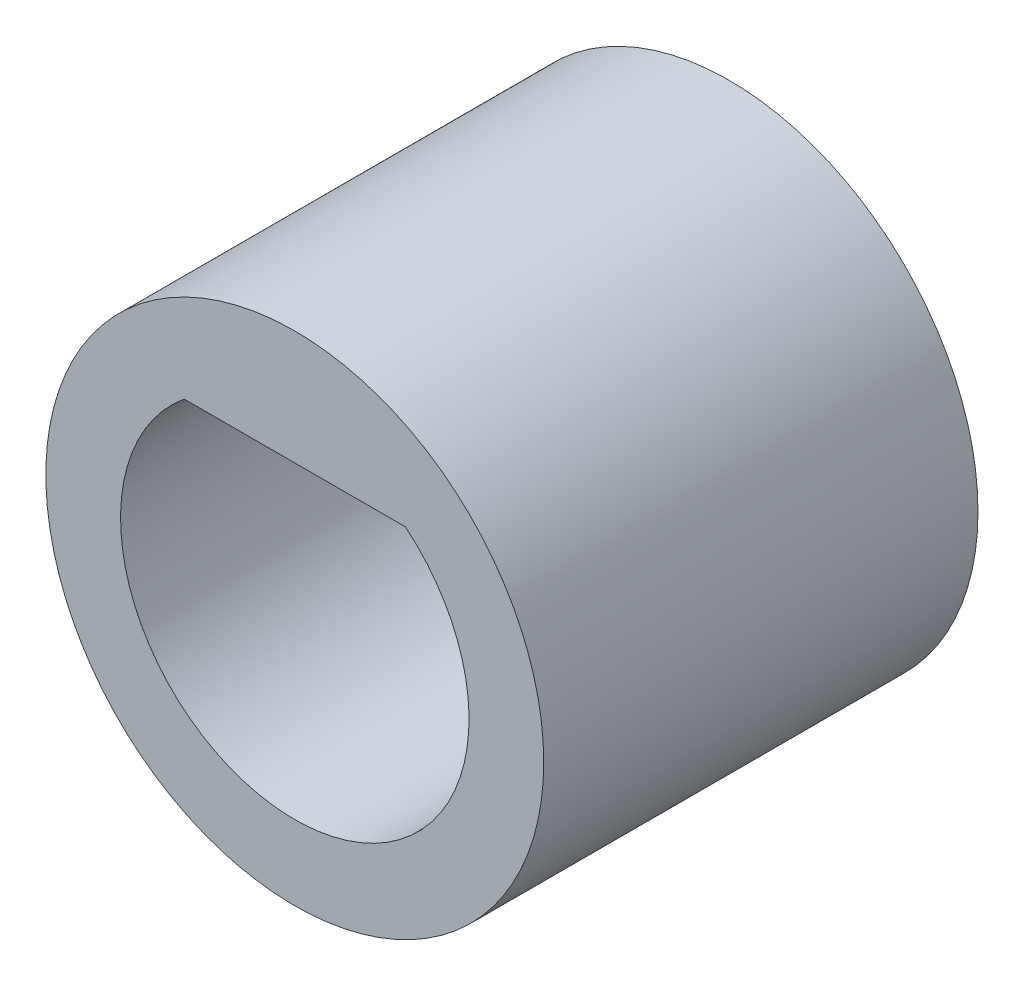
ISO-10303-21;
HEADER;
FILE_DESCRIPTION(('STEP AP214'),'2;1');
FILE_NAME('part.step','',(''),(''),'','','');
FILE_SCHEMA(('AUTOMOTIVE_DESIGN { 1 0 10303 214 1 1 1 1 }'));
ENDSEC;
DATA;
#1=APPLICATION_CONTEXT('core data for automotive mechanical design processes');
#2=APPLICATION_PROTOCOL_DEFINITION('international standard','automotive_design',2000,#1);
#3=PRODUCT_CONTEXT('',#1,'mechanical');
#4=PRODUCT('Part','Part','',(#3));
#5=PRODUCT_RELATED_PRODUCT_CATEGORY('part','',(#4));
#6=PRODUCT_DEFINITION_FORMATION('','',#4);
#7=PRODUCT_DEFINITION_CONTEXT('part definition',#1,'design');
#8=PRODUCT_DEFINITION('design','',#6,#7);
#9=PRODUCT_DEFINITION_SHAPE('','',#8);
#10=(LENGTH_UNIT() NAMED_UNIT(*) SI_UNIT(.MILLI.,.METRE.));
#11=(NAMED_UNIT(*) PLANE_ANGLE_UNIT() SI_UNIT($,.RADIAN.));
#12=(NAMED_UNIT(*) SI_UNIT($,.STERADIAN.) SOLID_ANGLE_UNIT());
#13=UNCERTAINTY_MEASURE_WITH_UNIT(LENGTH_MEASURE(1.E-05),#10,'distance_accuracy_value','');
#14=(GEOMETRIC_REPRESENTATION_CONTEXT(3) GLOBAL_UNCERTAINTY_ASSIGNED_CONTEXT((#13)) GLOBAL_UNIT_ASSIGNED_CONTEXT((#10,
#11,#12)) REPRESENTATION_CONTEXT('',''));
#15=CARTESIAN_POINT('',(0.,0.,0.));
#16=DIRECTION('',(0.,0.,1.));
#17=DIRECTION('',(1.,0.,0.));
#18=AXIS2_PLACEMENT_3D('',#15,#16,#17);
#19=CARTESIAN_POINT('',(0.,0.,9.968992));
#20=DIRECTION('',(0.,0.,-1.));
#21=DIRECTION('',(-1.,0.,0.));
#22=AXIS2_PLACEMENT_3D('',#19,#20,#21);
#23=CYLINDRICAL_SURFACE('',#22,2.3876);
#24=CARTESIAN_POINT('',(0.,0.,0.));
#25=DIRECTION('',(0.,0.,-1.));
#26=DIRECTION('',(-1.,0.,0.));
#27=AXIS2_PLACEMENT_3D('',#24,#25,#26);
#28=CIRCLE('',#27,2.3876);
#29=CARTESIAN_POINT('',(-2.3876,0.,0.));
#30=VERTEX_POINT('',#29);
#31=EDGE_CURVE('E84',#30,#30,#28,.T.);
#32=ORIENTED_EDGE('',*,*,#31,.T.);
#33=EDGE_LOOP('',(#32));
#34=FACE_BOUND('',#33,.T.);
#35=CARTESIAN_POINT('',(0.,0.,3.618992));
#36=DIRECTION('',(0.,0.,1.));
#37=DIRECTION('',(1.,0.,0.));
#38=AXIS2_PLACEMENT_3D('',#35,#36,#37);
#39=CIRCLE('',#38,2.3876);
#40=CARTESIAN_POINT('',(2.3876,0.,3.618992));
#41=VERTEX_POINT('',#40);
#42=EDGE_CURVE('E39',#41,#41,#39,.F.);
#43=ORIENTED_EDGE('',*,*,#42,.F.);
#44=EDGE_LOOP('',(#43));
#45=FACE_BOUND('',#44,.T.);
#46=ADVANCED_FACE('F35',(#34,#45),#23,.F.);
#47=CARTESIAN_POINT('',(0.,0.,9.968992));
#48=DIRECTION('',(0.,0.,-1.));
#49=DIRECTION('',(-1.,0.,0.));
#50=AXIS2_PLACEMENT_3D('',#47,#48,#49);
#51=CYLINDRICAL_SURFACE('',#50,5.715);
#52=CARTESIAN_POINT('',(0.,0.,9.968992));
#53=DIRECTION('',(0.,0.,1.));
#54=DIRECTION('',(1.,0.,0.));
#55=AXIS2_PLACEMENT_3D('',#52,#53,#54);
#56=CIRCLE('',#55,5.715);
#57=CARTESIAN_POINT('',(5.715,0.,9.968992));
#58=VERTEX_POINT('',#57);
#59=EDGE_CURVE('E11',#58,#58,#56,.T.);
#60=ORIENTED_EDGE('',*,*,#59,.F.);
#61=EDGE_LOOP('',(#60));
#62=FACE_BOUND('',#61,.T.);
#63=CARTESIAN_POINT('',(0.,0.,0.));
#64=DIRECTION('',(0.,0.,1.));
#65=DIRECTION('',(1.,0.,0.));
#66=AXIS2_PLACEMENT_3D('',#63,#64,#65);
#67=CIRCLE('',#66,5.715);
#68=CARTESIAN_POINT('',(5.715,0.,0.));
#69=VERTEX_POINT('',#68);
#70=EDGE_CURVE('E44',#69,#69,#67,.T.);
#71=ORIENTED_EDGE('',*,*,#70,.T.);
#72=EDGE_LOOP('',(#71));
#73=FACE_BOUND('',#72,.T.);
#74=ADVANCED_FACE('F37',(#62,#73),#51,.T.);
#75=CARTESIAN_POINT('',(0.,0.,9.968992));
#76=DIRECTION('',(0.,0.,1.));
#77=DIRECTION('',(1.,0.,0.));
#78=AXIS2_PLACEMENT_3D('',#75,#76,#77);
#79=PLANE('',#78);
#80=CARTESIAN_POINT('',(0.,0.,9.968992));
#81=DIRECTION('',(0.,0.,1.));
#82=DIRECTION('',(1.,0.,0.));
#83=AXIS2_PLACEMENT_3D('',#80,#81,#82);
#84=CIRCLE('',#83,4.);
#85=CARTESIAN_POINT('',(-2.54,3.09004854330802,9.968992));
#86=VERTEX_POINT('',#85);
#87=CARTESIAN_POINT('',(2.54,3.09004854330802,9.968992));
#88=VERTEX_POINT('',#87);
#89=EDGE_CURVE('E52',#86,#88,#84,.T.);
#90=ORIENTED_EDGE('',*,*,#89,.F.);
#91=DIRECTION('',(1.,0.,0.));
#92=VECTOR('',#91,1.);
#93=CARTESIAN_POINT('',(2.54,3.09004854330802,9.968992));
#94=LINE('',#93,#92);
#95=EDGE_CURVE('E69',#86,#88,#94,.T.);
#96=ORIENTED_EDGE('',*,*,#95,.T.);
#97=EDGE_LOOP('',(#90,#96));
#98=FACE_BOUND('',#97,.T.);
#99=ORIENTED_EDGE('',*,*,#59,.T.);
#100=EDGE_LOOP('',(#99));
#101=FACE_BOUND('',#100,.T.);
#102=ADVANCED_FACE('F66',(#98,#101),#79,.T.);
#103=CARTESIAN_POINT('',(0.,0.,0.));
#104=DIRECTION('',(0.,0.,1.));
#105=DIRECTION('',(1.,0.,0.));
#106=AXIS2_PLACEMENT_3D('',#103,#104,#105);
#107=PLANE('',#106);
#108=ORIENTED_EDGE('',*,*,#31,.F.);
#109=EDGE_LOOP('',(#108));
#110=FACE_BOUND('',#109,.T.);
#111=ORIENTED_EDGE('',*,*,#70,.F.);
#112=EDGE_LOOP('',(#111));
#113=FACE_BOUND('',#112,.T.);
#114=ADVANCED_FACE('F90',(#110,#113),#107,.F.);
#115=CARTESIAN_POINT('',(0.,0.,3.618992));
#116=DIRECTION('',(0.,0.,1.));
#117=DIRECTION('',(1.,0.,0.));
#118=AXIS2_PLACEMENT_3D('',#115,#116,#117);
#119=PLANE('',#118);
#120=DIRECTION('',(-1.,0.,0.));
#121=VECTOR('',#120,1.);
#122=CARTESIAN_POINT('',(2.54,3.09004854330802,3.618992));
#123=LINE('',#122,#121);
#124=CARTESIAN_POINT('',(2.54,3.09004854330802,3.618992));
#125=VERTEX_POINT('',#124);
#126=CARTESIAN_POINT('',(-2.54,3.09004854330802,3.618992));
#127=VERTEX_POINT('',#126);
#128=EDGE_CURVE('E59',#125,#127,#123,.T.);
#129=ORIENTED_EDGE('',*,*,#128,.T.);
#130=CARTESIAN_POINT('',(0.,0.,3.618992));
#131=DIRECTION('',(0.,0.,1.));
#132=DIRECTION('',(1.,0.,0.));
#133=AXIS2_PLACEMENT_3D('',#130,#131,#132);
#134=CIRCLE('',#133,4.);
#135=EDGE_CURVE('E70',#127,#125,#134,.T.);
#136=ORIENTED_EDGE('',*,*,#135,.T.);
#137=EDGE_LOOP('',(#129,#136));
#138=FACE_BOUND('',#137,.T.);
#139=ORIENTED_EDGE('',*,*,#42,.T.);
#140=EDGE_LOOP('',(#139));
#141=FACE_BOUND('',#140,.T.);
#142=ADVANCED_FACE('F92',(#138,#141),#119,.T.);
#143=CARTESIAN_POINT('',(0.,0.,3.618992));
#144=DIRECTION('',(0.,0.,1.));
#145=DIRECTION('',(1.,0.,0.));
#146=AXIS2_PLACEMENT_3D('',#143,#144,#145);
#147=CYLINDRICAL_SURFACE('',#146,4.);
#148=ORIENTED_EDGE('',*,*,#89,.T.);
#149=DIRECTION('',(0.,0.,1.));
#150=VECTOR('',#149,1.);
#151=CARTESIAN_POINT('',(2.54,3.09004854330802,-1.5418617717645));
#152=LINE('',#151,#150);
#153=EDGE_CURVE('E76',#125,#88,#152,.T.);
#154=ORIENTED_EDGE('',*,*,#153,.F.);
#155=ORIENTED_EDGE('',*,*,#135,.F.);
#156=DIRECTION('',(0.,0.,1.));
#157=VECTOR('',#156,1.);
#158=CARTESIAN_POINT('',(-2.54,3.09004854330802,-1.5418617717645));
#159=LINE('',#158,#157);
#160=EDGE_CURVE('E73',#127,#86,#159,.T.);
#161=ORIENTED_EDGE('',*,*,#160,.T.);
#162=EDGE_LOOP('',(#148,#154,#155,#161));
#163=FACE_BOUND('',#162,.T.);
#164=ADVANCED_FACE('F74',(#163),#147,.F.);
#165=CARTESIAN_POINT('',(2.54,3.09004854330802,-1.5418617717645));
#166=DIRECTION('',(0.,-1.,0.));
#167=DIRECTION('',(0.,0.,-1.));
#168=AXIS2_PLACEMENT_3D('',#165,#166,#167);
#169=PLANE('',#168);
#170=ORIENTED_EDGE('',*,*,#128,.F.);
#171=ORIENTED_EDGE('',*,*,#153,.T.);
#172=ORIENTED_EDGE('',*,*,#95,.F.);
#173=ORIENTED_EDGE('',*,*,#160,.F.);
#174=EDGE_LOOP('',(#170,#171,#172,#173));
#175=FACE_BOUND('',#174,.T.);
#176=ADVANCED_FACE('F78',(#175),#169,.T.);
#177=CLOSED_SHELL('',(#46,#74,#102,#114,#142,#164,#176));
#178=MANIFOLD_SOLID_BREP('B2',#177);
#179=ADVANCED_BREP_SHAPE_REPRESENTATION('',(#18,#178),#14);
#180=SHAPE_DEFINITION_REPRESENTATION(#9,#179);
ENDSEC;
END-ISO-10303-21;
